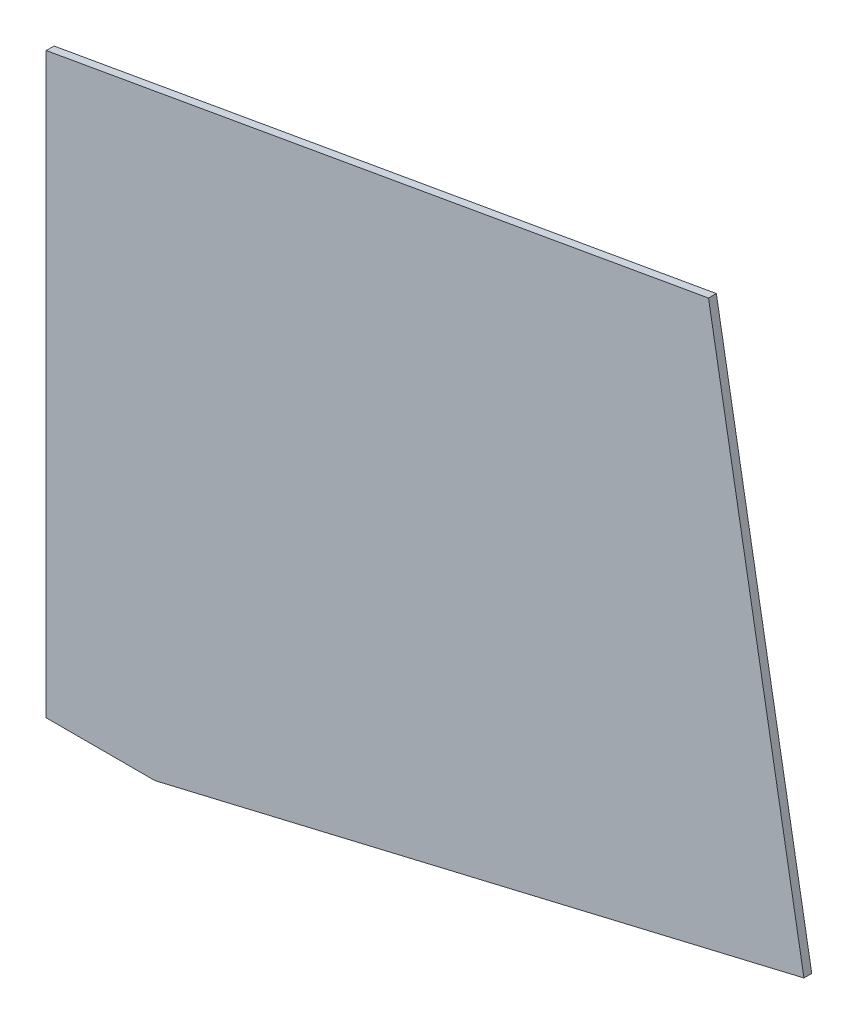
ISO-10303-21;
HEADER;
FILE_DESCRIPTION(('STEP AP214'),'2;1');
FILE_NAME('part.step','',(''),(''),'','','');
FILE_SCHEMA(('AUTOMOTIVE_DESIGN { 1 0 10303 214 1 1 1 1 }'));
ENDSEC;
DATA;
#1=APPLICATION_CONTEXT('core data for automotive mechanical design processes');
#2=APPLICATION_PROTOCOL_DEFINITION('international standard','automotive_design',2000,#1);
#3=PRODUCT_CONTEXT('',#1,'mechanical');
#4=PRODUCT('Part','Part','',(#3));
#5=PRODUCT_RELATED_PRODUCT_CATEGORY('part','',(#4));
#6=PRODUCT_DEFINITION_FORMATION('','',#4);
#7=PRODUCT_DEFINITION_CONTEXT('part definition',#1,'design');
#8=PRODUCT_DEFINITION('design','',#6,#7);
#9=PRODUCT_DEFINITION_SHAPE('','',#8);
#10=(LENGTH_UNIT() NAMED_UNIT(*) SI_UNIT(.MILLI.,.METRE.));
#11=(NAMED_UNIT(*) PLANE_ANGLE_UNIT() SI_UNIT($,.RADIAN.));
#12=(NAMED_UNIT(*) SI_UNIT($,.STERADIAN.) SOLID_ANGLE_UNIT());
#13=UNCERTAINTY_MEASURE_WITH_UNIT(LENGTH_MEASURE(1.E-05),#10,'distance_accuracy_value','');
#14=(GEOMETRIC_REPRESENTATION_CONTEXT(3) GLOBAL_UNCERTAINTY_ASSIGNED_CONTEXT((#13)) GLOBAL_UNIT_ASSIGNED_CONTEXT((#10,
#11,#12)) REPRESENTATION_CONTEXT('',''));
#15=CARTESIAN_POINT('',(0.,0.,0.));
#16=DIRECTION('',(0.,0.,1.));
#17=DIRECTION('',(1.,0.,0.));
#18=AXIS2_PLACEMENT_3D('',#15,#16,#17);
#19=CARTESIAN_POINT('',(0.,0.,2.3622));
#20=DIRECTION('',(1.,0.,0.));
#21=DIRECTION('',(0.,1.,0.));
#22=AXIS2_PLACEMENT_3D('',#19,#20,#21);
#23=PLANE('',#22);
#24=DIRECTION('',(0.,-1.,0.));
#25=VECTOR('',#24,1.);
#26=CARTESIAN_POINT('',(0.,0.,0.));
#27=LINE('',#26,#25);
#28=CARTESIAN_POINT('',(-6.63163415620759E-13,174.625,0.));
#29=VERTEX_POINT('',#28);
#30=CARTESIAN_POINT('',(0.,0.,0.));
#31=VERTEX_POINT('',#30);
#32=EDGE_CURVE('E107',#29,#31,#27,.T.);
#33=ORIENTED_EDGE('',*,*,#32,.T.);
#34=DIRECTION('',(0.,0.,-1.));
#35=VECTOR('',#34,1.);
#36=CARTESIAN_POINT('',(0.,0.,2.3622));
#37=LINE('',#36,#35);
#38=CARTESIAN_POINT('',(0.,0.,2.3622));
#39=VERTEX_POINT('',#38);
#40=EDGE_CURVE('E11',#39,#31,#37,.T.);
#41=ORIENTED_EDGE('',*,*,#40,.F.);
#42=DIRECTION('',(0.,-1.,0.));
#43=VECTOR('',#42,1.);
#44=CARTESIAN_POINT('',(0.,0.,2.3622));
#45=LINE('',#44,#43);
#46=CARTESIAN_POINT('',(-6.63163415620759E-13,174.625,2.3622));
#47=VERTEX_POINT('',#46);
#48=EDGE_CURVE('E115',#47,#39,#45,.T.);
#49=ORIENTED_EDGE('',*,*,#48,.F.);
#50=DIRECTION('',(0.,0.,-1.));
#51=VECTOR('',#50,1.);
#52=CARTESIAN_POINT('',(-6.63163415620759E-13,174.625,2.3622));
#53=LINE('',#52,#51);
#54=EDGE_CURVE('E103',#47,#29,#53,.T.);
#55=ORIENTED_EDGE('',*,*,#54,.T.);
#56=EDGE_LOOP('',(#33,#41,#49,#55));
#57=FACE_BOUND('',#56,.T.);
#58=ADVANCED_FACE('F33',(#57),#23,.F.);
#59=CARTESIAN_POINT('',(0.,0.,2.3622));
#60=DIRECTION('',(-3.31966240766167E-12,1.,0.));
#61=DIRECTION('',(-1.,-3.31966240766167E-12,0.));
#62=AXIS2_PLACEMENT_3D('',#59,#60,#61);
#63=PLANE('',#62);
#64=DIRECTION('',(1.,3.31966240766167E-12,0.));
#65=VECTOR('',#64,1.);
#66=CARTESIAN_POINT('',(0.,0.,0.));
#67=LINE('',#66,#65);
#68=CARTESIAN_POINT('',(32.8675999997956,1.09109336149382E-10,0.));
#69=VERTEX_POINT('',#68);
#70=EDGE_CURVE('E110',#31,#69,#67,.T.);
#71=ORIENTED_EDGE('',*,*,#70,.T.);
#72=DIRECTION('',(0.,0.,-1.));
#73=VECTOR('',#72,1.);
#74=CARTESIAN_POINT('',(32.8675999997956,1.09109336149382E-10,2.3622));
#75=LINE('',#74,#73);
#76=CARTESIAN_POINT('',(32.8675999997956,1.09109336149382E-10,2.3622));
#77=VERTEX_POINT('',#76);
#78=EDGE_CURVE('E41',#77,#69,#75,.T.);
#79=ORIENTED_EDGE('',*,*,#78,.F.);
#80=DIRECTION('',(1.,3.31966240766167E-12,0.));
#81=VECTOR('',#80,1.);
#82=CARTESIAN_POINT('',(0.,0.,2.3622));
#83=LINE('',#82,#81);
#84=EDGE_CURVE('E83',#39,#77,#83,.T.);
#85=ORIENTED_EDGE('',*,*,#84,.F.);
#86=ORIENTED_EDGE('',*,*,#40,.T.);
#87=EDGE_LOOP('',(#71,#79,#85,#86));
#88=FACE_BOUND('',#87,.T.);
#89=ADVANCED_FACE('F134',(#88),#63,.F.);
#90=CARTESIAN_POINT('',(228.944118190171,46.4005469744644,2.3622));
#91=DIRECTION('',(-0.230284850797219,0.973123264285313,0.));
#92=DIRECTION('',(-0.973123264285313,-0.230284850797219,0.));
#93=AXIS2_PLACEMENT_3D('',#90,#91,#92);
#94=PLANE('',#93);
#95=DIRECTION('',(0.973123264285313,0.230284850797219,0.));
#96=VECTOR('',#95,1.);
#97=CARTESIAN_POINT('',(228.944118190171,46.4005469744644,0.));
#98=LINE('',#97,#96);
#99=CARTESIAN_POINT('',(228.944118190171,46.4005469744644,0.));
#100=VERTEX_POINT('',#99);
#101=EDGE_CURVE('E98',#69,#100,#98,.T.);
#102=ORIENTED_EDGE('',*,*,#101,.T.);
#103=DIRECTION('',(0.,0.,-1.));
#104=VECTOR('',#103,1.);
#105=CARTESIAN_POINT('',(228.944118190171,46.4005469744644,2.3622));
#106=LINE('',#105,#104);
#107=CARTESIAN_POINT('',(228.944118190171,46.4005469744644,2.3622));
#108=VERTEX_POINT('',#107);
#109=EDGE_CURVE('E95',#108,#100,#106,.T.);
#110=ORIENTED_EDGE('',*,*,#109,.F.);
#111=DIRECTION('',(0.973123264285313,0.230284850797219,0.));
#112=VECTOR('',#111,1.);
#113=CARTESIAN_POINT('',(228.944118190171,46.4005469744644,2.3622));
#114=LINE('',#113,#112);
#115=EDGE_CURVE('E87',#77,#108,#114,.T.);
#116=ORIENTED_EDGE('',*,*,#115,.F.);
#117=ORIENTED_EDGE('',*,*,#78,.T.);
#118=EDGE_LOOP('',(#102,#110,#116,#117));
#119=FACE_BOUND('',#118,.T.);
#120=ADVANCED_FACE('F96',(#119),#94,.F.);
#121=CARTESIAN_POINT('',(228.944118190171,46.4005469744644,2.3622));
#122=DIRECTION('',(-0.984807753012207,-0.173648177666935,0.));
#123=DIRECTION('',(0.173648177666935,-0.984807753012207,0.));
#124=AXIS2_PLACEMENT_3D('',#121,#122,#123);
#125=PLANE('',#124);
#126=DIRECTION('',(-0.173648177666935,0.984807753012207,0.));
#127=VECTOR('',#126,1.);
#128=CARTESIAN_POINT('',(228.944118190171,46.4005469744644,0.));
#129=LINE('',#128,#127);
#130=CARTESIAN_POINT('',(200.11293541208,209.91030970192,0.));
#131=VERTEX_POINT('',#130);
#132=EDGE_CURVE('E69',#100,#131,#129,.T.);
#133=ORIENTED_EDGE('',*,*,#132,.T.);
#134=DIRECTION('',(0.,0.,-1.));
#135=VECTOR('',#134,1.);
#136=CARTESIAN_POINT('',(200.11293541208,209.91030970192,2.3622));
#137=LINE('',#136,#135);
#138=CARTESIAN_POINT('',(200.11293541208,209.91030970192,2.3622));
#139=VERTEX_POINT('',#138);
#140=EDGE_CURVE('E99',#139,#131,#137,.T.);
#141=ORIENTED_EDGE('',*,*,#140,.F.);
#142=DIRECTION('',(-0.173648177666935,0.984807753012207,0.));
#143=VECTOR('',#142,1.);
#144=CARTESIAN_POINT('',(228.944118190171,46.4005469744644,2.3622));
#145=LINE('',#144,#143);
#146=EDGE_CURVE('E91',#108,#139,#145,.T.);
#147=ORIENTED_EDGE('',*,*,#146,.F.);
#148=ORIENTED_EDGE('',*,*,#109,.T.);
#149=EDGE_LOOP('',(#133,#141,#147,#148));
#150=FACE_BOUND('',#149,.T.);
#151=ADVANCED_FACE('F101',(#150),#125,.F.);
#152=CARTESIAN_POINT('',(-6.63163415620759E-13,174.625,2.3622));
#153=DIRECTION('',(0.173648177666931,-0.984807753012208,0.));
#154=DIRECTION('',(0.984807753012208,0.173648177666931,0.));
#155=AXIS2_PLACEMENT_3D('',#152,#153,#154);
#156=PLANE('',#155);
#157=DIRECTION('',(-0.984807753012208,-0.173648177666931,0.));
#158=VECTOR('',#157,1.);
#159=CARTESIAN_POINT('',(-6.63163415620759E-13,174.625,0.));
#160=LINE('',#159,#158);
#161=EDGE_CURVE('E75',#131,#29,#160,.T.);
#162=ORIENTED_EDGE('',*,*,#161,.T.);
#163=ORIENTED_EDGE('',*,*,#54,.F.);
#164=DIRECTION('',(-0.984807753012208,-0.173648177666931,0.));
#165=VECTOR('',#164,1.);
#166=CARTESIAN_POINT('',(-6.63163415620759E-13,174.625,2.3622));
#167=LINE('',#166,#165);
#168=EDGE_CURVE('E49',#139,#47,#167,.T.);
#169=ORIENTED_EDGE('',*,*,#168,.F.);
#170=ORIENTED_EDGE('',*,*,#140,.T.);
#171=EDGE_LOOP('',(#162,#163,#169,#170));
#172=FACE_BOUND('',#171,.T.);
#173=ADVANCED_FACE('F123',(#172),#156,.F.);
#174=CARTESIAN_POINT('',(0.,0.,2.3622));
#175=DIRECTION('',(0.,0.,-1.));
#176=DIRECTION('',(-1.,0.,0.));
#177=AXIS2_PLACEMENT_3D('',#174,#175,#176);
#178=PLANE('',#177);
#179=ORIENTED_EDGE('',*,*,#48,.T.);
#180=ORIENTED_EDGE('',*,*,#84,.T.);
#181=ORIENTED_EDGE('',*,*,#115,.T.);
#182=ORIENTED_EDGE('',*,*,#146,.T.);
#183=ORIENTED_EDGE('',*,*,#168,.T.);
#184=EDGE_LOOP('',(#179,#180,#181,#182,#183));
#185=FACE_BOUND('',#184,.T.);
#186=ADVANCED_FACE('F89',(#185),#178,.F.);
#187=CARTESIAN_POINT('',(0.,0.,0.));
#188=DIRECTION('',(0.,0.,-1.));
#189=DIRECTION('',(-1.,0.,0.));
#190=AXIS2_PLACEMENT_3D('',#187,#188,#189);
#191=PLANE('',#190);
#192=ORIENTED_EDGE('',*,*,#32,.F.);
#193=ORIENTED_EDGE('',*,*,#161,.F.);
#194=ORIENTED_EDGE('',*,*,#132,.F.);
#195=ORIENTED_EDGE('',*,*,#101,.F.);
#196=ORIENTED_EDGE('',*,*,#70,.F.);
#197=EDGE_LOOP('',(#192,#193,#194,#195,#196));
#198=FACE_BOUND('',#197,.T.);
#199=ADVANCED_FACE('F119',(#198),#191,.T.);
#200=CLOSED_SHELL('',(#58,#89,#120,#151,#173,#186,#199));
#201=MANIFOLD_SOLID_BREP('B2',#200);
#202=ADVANCED_BREP_SHAPE_REPRESENTATION('',(#18,#201),#14);
#203=SHAPE_DEFINITION_REPRESENTATION(#9,#202);
ENDSEC;
END-ISO-10303-21;
